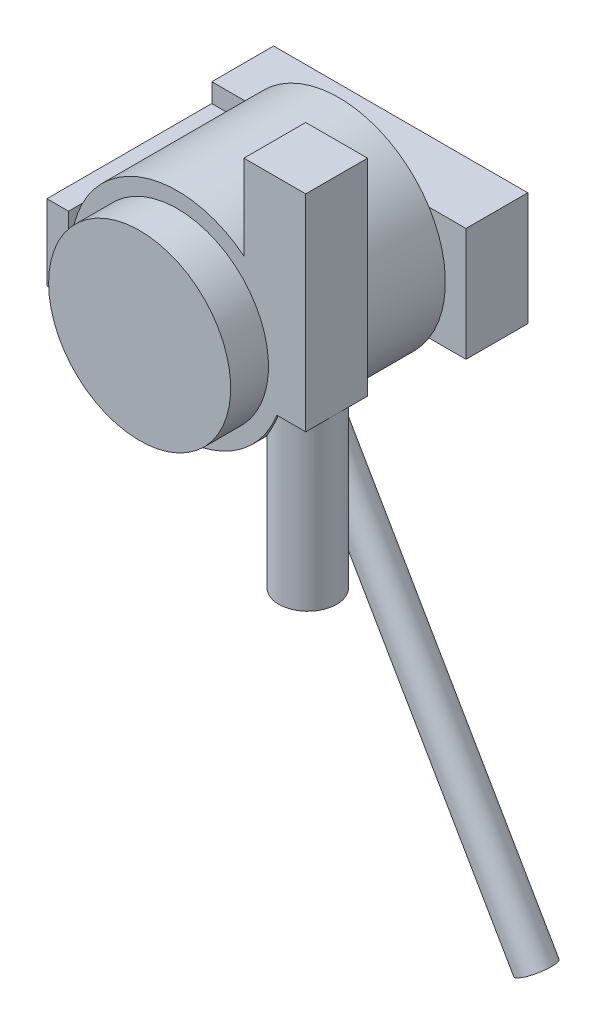
ISO-10303-21;
HEADER;
FILE_DESCRIPTION(('STEP AP214'),'2;1');
FILE_NAME('part.step','',(''),(''),'','','');
FILE_SCHEMA(('AUTOMOTIVE_DESIGN { 1 0 10303 214 1 1 1 1 }'));
ENDSEC;
DATA;
#1=APPLICATION_CONTEXT('core data for automotive mechanical design processes');
#2=APPLICATION_PROTOCOL_DEFINITION('international standard','automotive_design',2000,#1);
#3=PRODUCT_CONTEXT('',#1,'mechanical');
#4=PRODUCT('Part','Part','',(#3));
#5=PRODUCT_RELATED_PRODUCT_CATEGORY('part','',(#4));
#6=PRODUCT_DEFINITION_FORMATION('','',#4);
#7=PRODUCT_DEFINITION_CONTEXT('part definition',#1,'design');
#8=PRODUCT_DEFINITION('design','',#6,#7);
#9=PRODUCT_DEFINITION_SHAPE('','',#8);
#10=(LENGTH_UNIT() NAMED_UNIT(*) SI_UNIT(.MILLI.,.METRE.));
#11=(NAMED_UNIT(*) PLANE_ANGLE_UNIT() SI_UNIT($,.RADIAN.));
#12=(NAMED_UNIT(*) SI_UNIT($,.STERADIAN.) SOLID_ANGLE_UNIT());
#13=UNCERTAINTY_MEASURE_WITH_UNIT(LENGTH_MEASURE(1.E-05),#10,'distance_accuracy_value','');
#14=(GEOMETRIC_REPRESENTATION_CONTEXT(3) GLOBAL_UNCERTAINTY_ASSIGNED_CONTEXT((#13)) GLOBAL_UNIT_ASSIGNED_CONTEXT((#10,
#11,#12)) REPRESENTATION_CONTEXT('',''));
#15=CARTESIAN_POINT('',(0.,0.,0.));
#16=DIRECTION('',(0.,0.,1.));
#17=DIRECTION('',(1.,0.,0.));
#18=AXIS2_PLACEMENT_3D('',#15,#16,#17);
#19=CARTESIAN_POINT('',(45.9481178205376,-93.825,88.9));
#20=DIRECTION('',(0.,1.,0.));
#21=DIRECTION('',(0.,0.,1.));
#22=AXIS2_PLACEMENT_3D('',#19,#20,#21);
#23=CYLINDRICAL_SURFACE('',#22,13.3393821794624);
#24=CARTESIAN_POINT('',(45.9481178205376,-17.625,88.9));
#25=DIRECTION('',(0.,1.,0.));
#26=DIRECTION('',(0.,0.,1.));
#27=AXIS2_PLACEMENT_3D('',#24,#25,#26);
#28=CIRCLE('',#27,13.3393821794624);
#29=CARTESIAN_POINT('',(45.9481178205376,-17.625,102.239382179462));
#30=VERTEX_POINT('',#29);
#31=CARTESIAN_POINT('',(59.2875,-17.625,88.9));
#32=VERTEX_POINT('',#31);
#33=EDGE_CURVE('E232',#30,#32,#28,.T.);
#34=ORIENTED_EDGE('',*,*,#33,.F.);
#35=CARTESIAN_POINT('',(45.9481178205376,-17.625,75.5606178205375));
#36=CARTESIAN_POINT('',(45.7850283293745,-18.0501852849905,75.5606363292623));
#37=CARTESIAN_POINT('',(45.6160198088764,-18.4731255684856,75.5636099906256));
#38=CARTESIAN_POINT('',(45.2663431452935,-19.3141306011233,75.5768977045188));
#39=CARTESIAN_POINT('',(45.0856728235873,-19.7321944219357,75.5872131322447));
#40=CARTESIAN_POINT('',(44.7122985031022,-20.5642691077765,75.616663940997));
#41=CARTESIAN_POINT('',(44.5195568359291,-20.9782620925879,75.6358282548013));
#42=CARTESIAN_POINT('',(44.1228851542527,-21.8002150076966,75.6845702641384));
#43=CARTESIAN_POINT('',(43.9189557631223,-22.2081752725283,75.7141473799729));
#44=CARTESIAN_POINT('',(43.4971195417127,-23.0235663506581,75.7859544948887));
#45=CARTESIAN_POINT('',(43.2790480970429,-23.4308960630801,75.8283688883551));
#46=CARTESIAN_POINT('',(42.8323064654398,-24.2379117719866,75.9275988081342));
#47=CARTESIAN_POINT('',(42.6036368489969,-24.6375981782713,75.9844135600222));
#48=CARTESIAN_POINT('',(42.1367090043231,-25.4279030187809,76.1144248092656));
#49=CARTESIAN_POINT('',(41.898464221739,-25.8185330322634,76.1875989512116));
#50=CARTESIAN_POINT('',(41.4130669222193,-26.5901437632793,76.352565015676));
#51=CARTESIAN_POINT('',(41.1659159918857,-26.9711261791114,76.4443536354358));
#52=CARTESIAN_POINT('',(40.6475184222997,-27.7467267718029,76.6555674155957));
#53=CARTESIAN_POINT('',(40.3757507907897,-28.1406170942333,76.776403121361));
#54=CARTESIAN_POINT('',(39.8253283063993,-28.9143348086894,77.0448608583029));
#55=CARTESIAN_POINT('',(39.5466729006734,-29.2941610657142,77.1924850457201));
#56=CARTESIAN_POINT('',(38.986102739484,-30.0361328716376,77.516945318419));
#57=CARTESIAN_POINT('',(38.7042047943578,-30.3983412195405,77.693666012372));
#58=CARTESIAN_POINT('',(38.1393347426909,-31.104106345403,78.0796953937284));
#59=CARTESIAN_POINT('',(37.8563628688034,-31.4476669410933,78.2889973766083));
#60=CARTESIAN_POINT('',(37.3433605235149,-32.0542082082138,78.7026613036047));
#61=CARTESIAN_POINT('',(37.1128441011285,-32.3206711977625,78.9013119675197));
#62=CARTESIAN_POINT('',(36.6566064646245,-32.8372046750975,79.3238028329243));
#63=CARTESIAN_POINT('',(36.4308841771766,-33.087278858791,79.5476373239568));
#64=CARTESIAN_POINT('',(35.9874622445939,-33.5690316191516,80.0213917941978));
#65=CARTESIAN_POINT('',(35.7697599778493,-33.8007162361702,80.271303145087));
#66=CARTESIAN_POINT('',(35.3459581395932,-34.2436462170447,80.7976909314761));
#67=CARTESIAN_POINT('',(35.1398559547665,-34.454896192272,81.0741613453415));
#68=CARTESIAN_POINT('',(34.7833130809137,-34.8143917300752,81.594882877108));
#69=CARTESIAN_POINT('',(34.6300370070691,-34.9667455993692,81.8343656755764));
#70=CARTESIAN_POINT('',(34.3355711719435,-35.2559395780091,82.3295501382023));
#71=CARTESIAN_POINT('',(34.1943787920331,-35.392783050673,82.5852482673556));
#72=CARTESIAN_POINT('',(33.9262554830015,-35.6498788573786,83.1119732327698));
#73=CARTESIAN_POINT('',(33.7993222194261,-35.7701339079578,83.3829975489244));
#74=CARTESIAN_POINT('',(33.5618242760434,-35.9930639571399,83.9391272687547));
#75=CARTESIAN_POINT('',(33.4512599014892,-36.095738627903,84.2242329348923));
#76=CARTESIAN_POINT('',(33.247879958153,-36.2831627731605,84.8086218386205));
#77=CARTESIAN_POINT('',(33.1551790924692,-36.3677967525336,85.1079822459694));
#78=CARTESIAN_POINT('',(32.9902004394743,-36.517519955189,85.7170713481017));
#79=CARTESIAN_POINT('',(32.9179229751584,-36.5826088693681,86.026800206775));
#80=CARTESIAN_POINT('',(32.7952990002675,-36.6925784903267,86.6539944724956));
#81=CARTESIAN_POINT('',(32.7449452551267,-36.7374658635385,86.9714572908574));
#82=CARTESIAN_POINT('',(32.6672117517874,-36.8066048745461,87.6113938743908));
#83=CARTESIAN_POINT('',(32.6398296068328,-36.8308586561819,87.933867115431));
#84=CARTESIAN_POINT('',(32.6102614770623,-36.8570389308641,88.5468162037895));
#85=CARTESIAN_POINT('',(32.6057306032599,-36.8610434373321,88.8370943403532));
#86=CARTESIAN_POINT('',(32.6156065215821,-36.8523054802788,89.4170607771622));
#87=CARTESIAN_POINT('',(32.6300117679213,-36.8395643837276,89.7067491236195));
#88=CARTESIAN_POINT('',(32.6775010487976,-36.7974466548668,90.2832934077613));
#89=CARTESIAN_POINT('',(32.7105805995597,-36.7680740158519,90.570150008543));
#90=CARTESIAN_POINT('',(32.7948437403376,-36.6929360987634,91.1390118689828));
#91=CARTESIAN_POINT('',(32.8460274890728,-36.6471706769744,91.4210170860862));
#92=CARTESIAN_POINT('',(32.9641193275751,-36.5409786774113,91.9711639678511));
#93=CARTESIAN_POINT('',(33.0305967620745,-36.4809523831968,92.239475870176));
#94=CARTESIAN_POINT('',(33.1788967646995,-36.3461276896179,92.7680026953393));
#95=CARTESIAN_POINT('',(33.2607188618002,-36.2713297436854,93.0282178664318));
#96=CARTESIAN_POINT('',(33.4384997614933,-36.1074990672422,93.5391535255495));
#97=CARTESIAN_POINT('',(33.5344588584527,-36.018466040319,93.7898738157312));
#98=CARTESIAN_POINT('',(33.7391756424792,-35.8267754586706,94.2806656451043));
#99=CARTESIAN_POINT('',(33.8479347629442,-35.7241163778806,94.5207359875191));
#100=CARTESIAN_POINT('',(34.0850960364576,-35.4979594129291,95.0062259496359));
#101=CARTESIAN_POINT('',(34.2143498904387,-35.3734914735904,95.2507772162507));
#102=CARTESIAN_POINT('',(34.4841116210843,-35.1105635385418,95.72570726007));
#103=CARTESIAN_POINT('',(34.6246197199902,-34.9721032665066,95.9560857572414));
#104=CARTESIAN_POINT('',(34.9151408753514,-34.6820590021983,96.402227718645));
#105=CARTESIAN_POINT('',(35.065156975031,-34.530470802325,96.6179864573466));
#106=CARTESIAN_POINT('',(35.3729285327998,-34.2151234929614,97.0345925312868));
#107=CARTESIAN_POINT('',(35.5306854527959,-34.0513620814464,97.2354370317288));
#108=CARTESIAN_POINT('',(35.930250136898,-33.6304521375984,97.7159421868283));
#109=CARTESIAN_POINT('',(36.1757416537443,-33.366505565498,97.9866312307303));
#110=CARTESIAN_POINT('',(36.6752910612794,-32.8166316936644,98.4958930455081));
#111=CARTESIAN_POINT('',(36.9293522435876,-32.5306958926037,98.7344532959023));
#112=CARTESIAN_POINT('',(37.4421923881448,-31.9390952833113,99.1812538256778));
#113=CARTESIAN_POINT('',(37.7009777983759,-31.6334017969049,99.3894485354947));
#114=CARTESIAN_POINT('',(38.2193725228988,-31.0050930133637,99.7770569337767));
#115=CARTESIAN_POINT('',(38.4789818374198,-30.6824777115209,99.956470614234));
#116=CARTESIAN_POINT('',(39.1230015275927,-29.8605200305823,100.37026026478));
#117=CARTESIAN_POINT('',(39.5062107721469,-29.352064398853,100.588470528019));
#118=CARTESIAN_POINT('',(40.2610338946476,-28.307863662486,100.973769388855));
#119=CARTESIAN_POINT('',(40.6326412463026,-27.7721036292313,101.140829662837));
#120=CARTESIAN_POINT('',(41.3603941566605,-26.6762459849298,101.431798261981));
#121=CARTESIAN_POINT('',(41.7164833279104,-26.1160723705703,101.555559117703));
#122=CARTESIAN_POINT('',(42.4083603304322,-24.9768948991303,101.766234204345));
#123=CARTESIAN_POINT('',(42.7441524451084,-24.3978950550023,101.853156233014));
#124=CARTESIAN_POINT('',(43.3442589438274,-23.3124416453379,101.985817996853));
#125=CARTESIAN_POINT('',(43.6117143461181,-22.8082207361502,102.035792210333));
#126=CARTESIAN_POINT('',(44.1294719483856,-21.7895914594517,102.117424531596));
#127=CARTESIAN_POINT('',(44.3797735058133,-21.275182711254,102.149081953597));
#128=CARTESIAN_POINT('',(44.8601467490877,-20.242491718455,102.19711288351));
#129=CARTESIAN_POINT('',(45.0903928468562,-19.7242970185116,102.213633323037));
#130=CARTESIAN_POINT('',(45.532858253958,-18.680220746306,102.234743332024));
#131=CARTESIAN_POINT('',(45.7450835183454,-18.1543417811985,102.239336857737));
#132=CARTESIAN_POINT('',(45.9481178205376,-17.625,102.239382179462));
#133=B_SPLINE_CURVE_WITH_KNOTS('',3,(#35,#36,#37,#38,#39,#40,#41,#42,#43,#44,#45,#46,#47,#48,
#49,#50,#51,#52,#53,#54,#55,#56,#57,#58,#59,#60,#61,#62,#63,#64,#65,#66,#67,#68,#69,#70,#71,#72,
#73,#74,#75,#76,#77,#78,#79,#80,#81,#82,#83,#84,#85,#86,#87,#88,#89,#90,#91,#92,#93,#94,#95,#96,
#97,#98,#99,#100,#101,#102,#103,#104,#105,#106,#107,#108,#109,#110,#111,#112,#113,#114,#115,
#116,#117,#118,#119,#120,#121,#122,#123,#124,#125,#126,#127,#128,#129,#130,#131,#132),
.UNSPECIFIED.,.F.,.F.,(4,2,2,2,2,2,2,2,2,2,2,2,2,2,2,2,2,2,2,2,2,2,2,2,2,2,2,2,2,2,2,2,2,2,2,2,
2,2,2,2,2,2,2,2,2,2,2,2,4),(0.,1.36615444656034,2.7325648566726,4.10347493908439,
5.47430871268624,6.86585137020907,8.25731920900492,9.64689707909072,11.0362286123591,
12.5160417415762,13.9959740358143,15.4701726379126,16.944068281909,18.1564788796884,
19.368615114157,20.5803515408536,21.7918138807089,22.7586291552043,23.7252343800457,
24.6916811242041,25.6581458887457,26.6306234774797,27.6031164450393,28.5752882578489,
29.5473590491983,30.4173034000388,31.2871767403482,32.1568413093726,33.0265135029272,
33.8741797973363,34.721820075756,35.5694780066178,36.4172309520801,37.3262818781417,
38.2353507599577,39.144712091235,40.0542458276249,41.4045409238888,42.7553607122904,
44.108187265992,45.4610141960851,47.4769501737443,49.4940004381894,51.5178549990312,
53.5412809522457,55.2594591800977,56.9777017323707,58.6790832857099,60.379900405009),.UNSPECIFIED.);
#134=CARTESIAN_POINT('',(45.9481178205376,-17.625,75.5606178205375));
#135=VERTEX_POINT('',#134);
#136=EDGE_CURVE('E20',#135,#30,#133,.T.);
#137=ORIENTED_EDGE('',*,*,#136,.F.);
#138=CARTESIAN_POINT('',(45.9481178205376,-17.625,88.9));
#139=DIRECTION('',(0.,1.,0.));
#140=DIRECTION('',(0.,0.,1.));
#141=AXIS2_PLACEMENT_3D('',#138,#139,#140);
#142=CIRCLE('',#141,13.3393821794624);
#143=EDGE_CURVE('E40',#32,#135,#142,.T.);
#144=ORIENTED_EDGE('',*,*,#143,.F.);
#145=EDGE_LOOP('',(#34,#137,#144));
#146=FACE_BOUND('',#145,.T.);
#147=CARTESIAN_POINT('',(45.9481178205376,-93.825,88.9));
#148=DIRECTION('',(0.,1.,0.));
#149=DIRECTION('',(0.,0.,1.));
#150=AXIS2_PLACEMENT_3D('',#147,#148,#149);
#151=CIRCLE('',#150,13.3393821794624);
#152=CARTESIAN_POINT('',(45.9481178205376,-93.825,102.239382179462));
#153=VERTEX_POINT('',#152);
#154=EDGE_CURVE('E11',#153,#153,#151,.T.);
#155=ORIENTED_EDGE('',*,*,#154,.T.);
#156=EDGE_LOOP('',(#155));
#157=FACE_BOUND('',#156,.T.);
#158=ADVANCED_FACE('F16',(#146,#157),#23,.T.);
#159=CARTESIAN_POINT('',(0.,0.,120.65));
#160=DIRECTION('',(0.,0.,-1.));
#161=DIRECTION('',(-1.,0.,0.));
#162=AXIS2_PLACEMENT_3D('',#159,#160,#161);
#163=CYLINDRICAL_SURFACE('',#162,42.06875);
#164=CARTESIAN_POINT('',(0.,0.,103.1875));
#165=DIRECTION('',(0.,0.,-1.));
#166=DIRECTION('',(-1.,0.,0.));
#167=AXIS2_PLACEMENT_3D('',#164,#165,#166);
#168=CIRCLE('',#167,42.06875);
#169=CARTESIAN_POINT('',(-42.06875,0.,103.1875));
#170=VERTEX_POINT('',#169);
#171=EDGE_CURVE('E213',#170,#170,#168,.T.);
#172=ORIENTED_EDGE('',*,*,#171,.F.);
#173=EDGE_LOOP('',(#172));
#174=FACE_BOUND('',#173,.T.);
#175=CARTESIAN_POINT('',(0.,0.,120.65));
#176=DIRECTION('',(0.,0.,-1.));
#177=DIRECTION('',(-1.,0.,0.));
#178=AXIS2_PLACEMENT_3D('',#175,#176,#177);
#179=CIRCLE('',#178,42.06875);
#180=CARTESIAN_POINT('',(-42.06875,0.,120.65));
#181=VERTEX_POINT('',#180);
#182=EDGE_CURVE('E32',#181,#181,#179,.T.);
#183=ORIENTED_EDGE('',*,*,#182,.T.);
#184=EDGE_LOOP('',(#183));
#185=FACE_BOUND('',#184,.T.);
#186=ADVANCED_FACE('F406',(#174,#185),#163,.T.);
#187=CARTESIAN_POINT('',(126.20625,-218.59563723274,63.4898768792733));
#188=DIRECTION('',(-0.499999999999998,0.86602540378444,0.));
#189=DIRECTION('',(-0.86602540378444,-0.499999999999998,0.));
#190=AXIS2_PLACEMENT_3D('',#187,#188,#189);
#191=CYLINDRICAL_SURFACE('',#190,7.9375);
#192=CARTESIAN_POINT('',(24.6062499999999,-42.6192751837417,63.4898768792733));
#193=DIRECTION('',(-0.499999999999998,0.86602540378444,0.));
#194=DIRECTION('',(-0.86602540378444,-0.499999999999998,0.));
#195=AXIS2_PLACEMENT_3D('',#192,#193,#194);
#196=CIRCLE('',#195,7.9375);
#197=CARTESIAN_POINT('',(17.7321733574609,-46.5880251837417,63.4898768792733));
#198=VERTEX_POINT('',#197);
#199=EDGE_CURVE('E329',#198,#198,#196,.T.);
#200=ORIENTED_EDGE('',*,*,#199,.F.);
#201=EDGE_LOOP('',(#200));
#202=FACE_BOUND('',#201,.T.);
#203=CARTESIAN_POINT('',(126.20625,-218.59563723274,63.4898768792733));
#204=DIRECTION('',(-0.499999999999998,0.86602540378444,0.));
#205=DIRECTION('',(-0.86602540378444,-0.499999999999998,0.));
#206=AXIS2_PLACEMENT_3D('',#203,#204,#205);
#207=CIRCLE('',#206,7.9375);
#208=CARTESIAN_POINT('',(119.332173357461,-222.56438723274,63.4898768792733));
#209=VERTEX_POINT('',#208);
#210=EDGE_CURVE('E198',#209,#209,#207,.T.);
#211=ORIENTED_EDGE('',*,*,#210,.T.);
#212=EDGE_LOOP('',(#211));
#213=FACE_BOUND('',#212,.T.);
#214=ADVANCED_FACE('F726',(#202,#213),#191,.T.);
#215=CARTESIAN_POINT('',(0.,0.,103.1875));
#216=DIRECTION('',(0.,0.,-1.));
#217=DIRECTION('',(-1.,0.,0.));
#218=AXIS2_PLACEMENT_3D('',#215,#216,#217);
#219=CYLINDRICAL_SURFACE('',#218,49.2125);
#220=CARTESIAN_POINT('',(0.,0.,74.6125));
#221=DIRECTION('',(0.,0.,-1.));
#222=DIRECTION('',(-1.,0.,0.));
#223=AXIS2_PLACEMENT_3D('',#220,#221,#222);
#224=CIRCLE('',#223,49.2125);
#225=CARTESIAN_POINT('',(30.7125,38.4527307222777,74.6125));
#226=VERTEX_POINT('',#225);
#227=CARTESIAN_POINT('',(45.9481178205376,-17.625,74.6125));
#228=VERTEX_POINT('',#227);
#229=EDGE_CURVE('E182',#226,#228,#224,.T.);
#230=ORIENTED_EDGE('',*,*,#229,.T.);
#231=DIRECTION('',(0.,0.,-1.));
#232=VECTOR('',#231,1.);
#233=CARTESIAN_POINT('',(45.9481178205376,-17.625,74.6125));
#234=LINE('',#233,#232);
#235=EDGE_CURVE('E303',#135,#228,#234,.T.);
#236=ORIENTED_EDGE('',*,*,#235,.F.);
#237=ORIENTED_EDGE('',*,*,#136,.T.);
#238=DIRECTION('',(0.,0.,-1.));
#239=VECTOR('',#238,1.);
#240=CARTESIAN_POINT('',(45.9481178205376,-17.625,74.6125));
#241=LINE('',#240,#239);
#242=CARTESIAN_POINT('',(45.9481178205376,-17.625,103.1875));
#243=VERTEX_POINT('',#242);
#244=EDGE_CURVE('E312',#243,#30,#241,.T.);
#245=ORIENTED_EDGE('',*,*,#244,.F.);
#246=CARTESIAN_POINT('',(0.,0.,103.1875));
#247=DIRECTION('',(0.,0.,-1.));
#248=DIRECTION('',(-1.,0.,0.));
#249=AXIS2_PLACEMENT_3D('',#246,#247,#248);
#250=CIRCLE('',#249,49.2125);
#251=CARTESIAN_POINT('',(-48.7375,-6.82101532031737,103.1875));
#252=VERTEX_POINT('',#251);
#253=EDGE_CURVE('E354',#243,#252,#250,.T.);
#254=ORIENTED_EDGE('',*,*,#253,.T.);
#255=DIRECTION('',(0.,0.,-1.));
#256=VECTOR('',#255,1.);
#257=CARTESIAN_POINT('',(-48.7375,-6.82101532031738,103.1875));
#258=LINE('',#257,#256);
#259=CARTESIAN_POINT('',(-48.7375,-6.82101532031737,28.575));
#260=VERTEX_POINT('',#259);
#261=EDGE_CURVE('E359',#252,#260,#258,.T.);
#262=ORIENTED_EDGE('',*,*,#261,.T.);
#263=CARTESIAN_POINT('',(0.,0.,28.575));
#264=DIRECTION('',(0.,0.,1.));
#265=DIRECTION('',(-1.,0.,0.));
#266=AXIS2_PLACEMENT_3D('',#263,#264,#265);
#267=CIRCLE('',#266,49.2125);
#268=CARTESIAN_POINT('',(-41.662424523634,-26.19375,28.575));
#269=VERTEX_POINT('',#268);
#270=EDGE_CURVE('E361',#260,#269,#267,.T.);
#271=ORIENTED_EDGE('',*,*,#270,.T.);
#272=CARTESIAN_POINT('',(0.,0.,28.575));
#273=DIRECTION('',(0.,0.,1.));
#274=DIRECTION('',(-1.,0.,0.));
#275=AXIS2_PLACEMENT_3D('',#272,#273,#274);
#276=CIRCLE('',#275,49.2125);
#277=CARTESIAN_POINT('',(41.662424523634,-26.19375,28.575));
#278=VERTEX_POINT('',#277);
#279=EDGE_CURVE('E367',#269,#278,#276,.T.);
#280=ORIENTED_EDGE('',*,*,#279,.T.);
#281=CARTESIAN_POINT('',(0.,0.,28.575));
#282=DIRECTION('',(0.,0.,1.));
#283=DIRECTION('',(-1.,0.,0.));
#284=AXIS2_PLACEMENT_3D('',#281,#282,#283);
#285=CIRCLE('',#284,49.2125);
#286=CARTESIAN_POINT('',(41.662424523634,26.19375,28.575));
#287=VERTEX_POINT('',#286);
#288=EDGE_CURVE('E370',#278,#287,#285,.T.);
#289=ORIENTED_EDGE('',*,*,#288,.T.);
#290=CARTESIAN_POINT('',(0.,0.,28.575));
#291=DIRECTION('',(0.,0.,1.));
#292=DIRECTION('',(-1.,0.,0.));
#293=AXIS2_PLACEMENT_3D('',#290,#291,#292);
#294=CIRCLE('',#293,49.2125);
#295=CARTESIAN_POINT('',(-41.662424523634,26.19375,28.575));
#296=VERTEX_POINT('',#295);
#297=EDGE_CURVE('E373',#287,#296,#294,.T.);
#298=ORIENTED_EDGE('',*,*,#297,.T.);
#299=CARTESIAN_POINT('',(0.,0.,28.575));
#300=DIRECTION('',(0.,0.,1.));
#301=DIRECTION('',(-1.,0.,0.));
#302=AXIS2_PLACEMENT_3D('',#299,#300,#301);
#303=CIRCLE('',#302,49.2125);
#304=CARTESIAN_POINT('',(-48.7375,6.82101532031735,28.575));
#305=VERTEX_POINT('',#304);
#306=EDGE_CURVE('E376',#296,#305,#303,.T.);
#307=ORIENTED_EDGE('',*,*,#306,.T.);
#308=DIRECTION('',(0.,0.,1.));
#309=VECTOR('',#308,1.);
#310=CARTESIAN_POINT('',(-48.7375,6.82101532031735,103.1875));
#311=LINE('',#310,#309);
#312=CARTESIAN_POINT('',(-48.7375,6.82101532031735,103.1875));
#313=VERTEX_POINT('',#312);
#314=EDGE_CURVE('E379',#305,#313,#311,.T.);
#315=ORIENTED_EDGE('',*,*,#314,.T.);
#316=CARTESIAN_POINT('',(0.,0.,103.1875));
#317=DIRECTION('',(0.,0.,-1.));
#318=DIRECTION('',(-1.,0.,0.));
#319=AXIS2_PLACEMENT_3D('',#316,#317,#318);
#320=CIRCLE('',#319,49.2125);
#321=CARTESIAN_POINT('',(30.7125,38.4527307222777,103.1875));
#322=VERTEX_POINT('',#321);
#323=EDGE_CURVE('E185',#313,#322,#320,.T.);
#324=ORIENTED_EDGE('',*,*,#323,.T.);
#325=DIRECTION('',(0.,0.,-1.));
#326=VECTOR('',#325,1.);
#327=CARTESIAN_POINT('',(30.7125,38.4527307222777,103.1875));
#328=LINE('',#327,#326);
#329=EDGE_CURVE('E178',#322,#226,#328,.T.);
#330=ORIENTED_EDGE('',*,*,#329,.T.);
#331=EDGE_LOOP('',(#230,#236,#237,#245,#254,#262,#271,#280,#289,#298,#307,#315,#324,#330));
#332=FACE_BOUND('',#331,.T.);
#333=CARTESIAN_POINT('',(0.,0.,50.9449462977674));
#334=DIRECTION('',(0.,0.,-1.));
#335=DIRECTION('',(-1.,0.,0.));
#336=AXIS2_PLACEMENT_3D('',#333,#334,#335);
#337=CIRCLE('',#336,49.2125);
#338=CARTESIAN_POINT('',(34.5218201413073,-35.0729823422706,50.9449462977674));
#339=VERTEX_POINT('',#338);
#340=CARTESIAN_POINT('',(24.6062499999999,-42.6192751837417,50.9449462977674));
#341=VERTEX_POINT('',#340);
#342=EDGE_CURVE('E189',#339,#341,#337,.T.);
#343=ORIENTED_EDGE('',*,*,#342,.T.);
#344=CARTESIAN_POINT('',(0.,0.,50.9449462977674));
#345=DIRECTION('',(0.,0.,-1.));
#346=DIRECTION('',(-1.,0.,0.));
#347=AXIS2_PLACEMENT_3D('',#344,#345,#346);
#348=CIRCLE('',#347,49.2125);
#349=CARTESIAN_POINT('',(12.4340295875087,-47.6158068761515,50.9449462977674));
#350=VERTEX_POINT('',#349);
#351=EDGE_CURVE('E384',#341,#350,#348,.T.);
#352=ORIENTED_EDGE('',*,*,#351,.T.);
#353=DIRECTION('',(0.,0.,1.));
#354=VECTOR('',#353,1.);
#355=CARTESIAN_POINT('',(12.4340295875088,-47.6158068761515,103.1875));
#356=LINE('',#355,#354);
#357=CARTESIAN_POINT('',(12.4340295875087,-47.6158068761515,76.3449462977675));
#358=VERTEX_POINT('',#357);
#359=EDGE_CURVE('E387',#350,#358,#356,.T.);
#360=ORIENTED_EDGE('',*,*,#359,.T.);
#361=CARTESIAN_POINT('',(0.,0.,76.3449462977675));
#362=DIRECTION('',(0.,0.,1.));
#363=DIRECTION('',(-1.,0.,0.));
#364=AXIS2_PLACEMENT_3D('',#361,#362,#363);
#365=CIRCLE('',#364,49.2125);
#366=CARTESIAN_POINT('',(24.6062499999999,-42.6192751837417,76.3449462977675));
#367=VERTEX_POINT('',#366);
#368=EDGE_CURVE('E390',#358,#367,#365,.T.);
#369=ORIENTED_EDGE('',*,*,#368,.T.);
#370=CARTESIAN_POINT('',(0.,0.,76.3449462977675));
#371=DIRECTION('',(0.,0.,1.));
#372=DIRECTION('',(-1.,0.,0.));
#373=AXIS2_PLACEMENT_3D('',#370,#371,#372);
#374=CIRCLE('',#373,49.2125);
#375=CARTESIAN_POINT('',(34.5218201413073,-35.0729823422706,76.3449462977675));
#376=VERTEX_POINT('',#375);
#377=EDGE_CURVE('E393',#367,#376,#374,.T.);
#378=ORIENTED_EDGE('',*,*,#377,.T.);
#379=DIRECTION('',(0.,0.,-1.));
#380=VECTOR('',#379,1.);
#381=CARTESIAN_POINT('',(34.5218201413073,-35.0729823422706,103.1875));
#382=LINE('',#381,#380);
#383=EDGE_CURVE('E396',#376,#339,#382,.T.);
#384=ORIENTED_EDGE('',*,*,#383,.T.);
#385=EDGE_LOOP('',(#343,#352,#360,#369,#378,#384));
#386=FACE_BOUND('',#385,.T.);
#387=ADVANCED_FACE('F180',(#332,#386),#219,.T.);
#388=CARTESIAN_POINT('',(59.2875,77.625,74.6125));
#389=DIRECTION('',(0.,0.,-1.));
#390=DIRECTION('',(-1.,0.,0.));
#391=AXIS2_PLACEMENT_3D('',#388,#389,#390);
#392=PLANE('',#391);
#393=DIRECTION('',(0.,-1.,0.));
#394=VECTOR('',#393,1.);
#395=CARTESIAN_POINT('',(59.2875,77.625,74.6125));
#396=LINE('',#395,#394);
#397=CARTESIAN_POINT('',(59.2875,77.625,74.6125));
#398=VERTEX_POINT('',#397);
#399=CARTESIAN_POINT('',(59.2875,-17.625,74.6125));
#400=VERTEX_POINT('',#399);
#401=EDGE_CURVE('E205',#398,#400,#396,.T.);
#402=ORIENTED_EDGE('',*,*,#401,.T.);
#403=DIRECTION('',(-1.,0.,0.));
#404=VECTOR('',#403,1.);
#405=CARTESIAN_POINT('',(59.2875,-17.625,74.6125));
#406=LINE('',#405,#404);
#407=EDGE_CURVE('E197',#400,#228,#406,.T.);
#408=ORIENTED_EDGE('',*,*,#407,.T.);
#409=ORIENTED_EDGE('',*,*,#229,.F.);
#410=DIRECTION('',(0.,1.,0.));
#411=VECTOR('',#410,1.);
#412=CARTESIAN_POINT('',(30.7125,77.625,74.6125));
#413=LINE('',#412,#411);
#414=CARTESIAN_POINT('',(30.7125,77.625,74.6125));
#415=VERTEX_POINT('',#414);
#416=EDGE_CURVE('E195',#226,#415,#413,.T.);
#417=ORIENTED_EDGE('',*,*,#416,.T.);
#418=DIRECTION('',(1.,0.,0.));
#419=VECTOR('',#418,1.);
#420=CARTESIAN_POINT('',(59.2875,77.625,74.6125));
#421=LINE('',#420,#419);
#422=EDGE_CURVE('E203',#415,#398,#421,.T.);
#423=ORIENTED_EDGE('',*,*,#422,.T.);
#424=EDGE_LOOP('',(#402,#408,#409,#417,#423));
#425=FACE_BOUND('',#424,.T.);
#426=ADVANCED_FACE('F194',(#425),#392,.T.);
#427=CARTESIAN_POINT('',(30.7125,-17.625,74.6125));
#428=DIRECTION('',(-1.,0.,0.));
#429=DIRECTION('',(0.,-1.,0.));
#430=AXIS2_PLACEMENT_3D('',#427,#428,#429);
#431=PLANE('',#430);
#432=DIRECTION('',(0.,0.,-1.));
#433=VECTOR('',#432,1.);
#434=CARTESIAN_POINT('',(30.7125,77.625,74.6125));
#435=LINE('',#434,#433);
#436=CARTESIAN_POINT('',(30.7125,77.625,103.1875));
#437=VERTEX_POINT('',#436);
#438=EDGE_CURVE('E202',#437,#415,#435,.T.);
#439=ORIENTED_EDGE('',*,*,#438,.T.);
#440=ORIENTED_EDGE('',*,*,#416,.F.);
#441=ORIENTED_EDGE('',*,*,#329,.F.);
#442=DIRECTION('',(0.,1.,0.));
#443=VECTOR('',#442,1.);
#444=CARTESIAN_POINT('',(30.7125,-17.625,103.1875));
#445=LINE('',#444,#443);
#446=EDGE_CURVE('E211',#322,#437,#445,.T.);
#447=ORIENTED_EDGE('',*,*,#446,.T.);
#448=EDGE_LOOP('',(#439,#440,#441,#447));
#449=FACE_BOUND('',#448,.T.);
#450=ADVANCED_FACE('F200',(#449),#431,.T.);
#451=CARTESIAN_POINT('',(0.,0.,103.1875));
#452=DIRECTION('',(0.,0.,1.));
#453=DIRECTION('',(1.,0.,0.));
#454=AXIS2_PLACEMENT_3D('',#451,#452,#453);
#455=PLANE('',#454);
#456=ORIENTED_EDGE('',*,*,#171,.T.);
#457=EDGE_LOOP('',(#456));
#458=FACE_BOUND('',#457,.T.);
#459=ORIENTED_EDGE('',*,*,#323,.F.);
#460=DIRECTION('',(0.,-1.,0.));
#461=VECTOR('',#460,1.);
#462=CARTESIAN_POINT('',(-48.7375,0.,103.1875));
#463=LINE('',#462,#461);
#464=EDGE_CURVE('E214',#313,#252,#463,.T.);
#465=ORIENTED_EDGE('',*,*,#464,.T.);
#466=ORIENTED_EDGE('',*,*,#253,.F.);
#467=DIRECTION('',(1.,0.,0.));
#468=VECTOR('',#467,1.);
#469=CARTESIAN_POINT('',(0.,-17.625,103.1875));
#470=LINE('',#469,#468);
#471=CARTESIAN_POINT('',(59.2875,-17.625,103.1875));
#472=VERTEX_POINT('',#471);
#473=EDGE_CURVE('E217',#243,#472,#470,.T.);
#474=ORIENTED_EDGE('',*,*,#473,.T.);
#475=DIRECTION('',(0.,1.,0.));
#476=VECTOR('',#475,1.);
#477=CARTESIAN_POINT('',(59.2875,0.,103.1875));
#478=LINE('',#477,#476);
#479=CARTESIAN_POINT('',(59.2875,77.625,103.1875));
#480=VERTEX_POINT('',#479);
#481=EDGE_CURVE('E220',#472,#480,#478,.T.);
#482=ORIENTED_EDGE('',*,*,#481,.T.);
#483=DIRECTION('',(-1.,0.,0.));
#484=VECTOR('',#483,1.);
#485=CARTESIAN_POINT('',(0.,77.625,103.1875));
#486=LINE('',#485,#484);
#487=EDGE_CURVE('E223',#480,#437,#486,.T.);
#488=ORIENTED_EDGE('',*,*,#487,.T.);
#489=ORIENTED_EDGE('',*,*,#446,.F.);
#490=EDGE_LOOP('',(#459,#465,#466,#474,#482,#488,#489));
#491=FACE_BOUND('',#490,.T.);
#492=ADVANCED_FACE('F357',(#458,#491),#455,.T.);
#493=CARTESIAN_POINT('',(-48.7375,17.4625,28.575));
#494=DIRECTION('',(-1.,0.,0.));
#495=DIRECTION('',(0.,0.,1.));
#496=AXIS2_PLACEMENT_3D('',#493,#494,#495);
#497=PLANE('',#496);
#498=ORIENTED_EDGE('',*,*,#314,.F.);
#499=DIRECTION('',(0.,-1.,0.));
#500=VECTOR('',#499,1.);
#501=CARTESIAN_POINT('',(-48.7375,17.4625,28.575));
#502=LINE('',#501,#500);
#503=CARTESIAN_POINT('',(-48.7375,17.4625,28.575));
#504=VERTEX_POINT('',#503);
#505=EDGE_CURVE('E226',#504,#305,#502,.T.);
#506=ORIENTED_EDGE('',*,*,#505,.F.);
#507=DIRECTION('',(0.,0.,-1.));
#508=VECTOR('',#507,1.);
#509=CARTESIAN_POINT('',(-48.7375,17.4625,28.575));
#510=LINE('',#509,#508);
#511=CARTESIAN_POINT('',(-48.7375,17.4625,104.775));
#512=VERTEX_POINT('',#511);
#513=EDGE_CURVE('E230',#512,#504,#510,.T.);
#514=ORIENTED_EDGE('',*,*,#513,.F.);
#515=DIRECTION('',(0.,1.,0.));
#516=VECTOR('',#515,1.);
#517=CARTESIAN_POINT('',(-48.7375,17.4625,104.775));
#518=LINE('',#517,#516);
#519=CARTESIAN_POINT('',(-48.7375,-17.4625,104.775));
#520=VERTEX_POINT('',#519);
#521=EDGE_CURVE('E234',#520,#512,#518,.T.);
#522=ORIENTED_EDGE('',*,*,#521,.F.);
#523=DIRECTION('',(0.,0.,1.));
#524=VECTOR('',#523,1.);
#525=CARTESIAN_POINT('',(-48.7375,-17.4625,28.575));
#526=LINE('',#525,#524);
#527=CARTESIAN_POINT('',(-48.7375,-17.4625,28.575));
#528=VERTEX_POINT('',#527);
#529=EDGE_CURVE('E238',#528,#520,#526,.T.);
#530=ORIENTED_EDGE('',*,*,#529,.F.);
#531=DIRECTION('',(0.,-1.,0.));
#532=VECTOR('',#531,1.);
#533=CARTESIAN_POINT('',(-48.7375,17.4625,28.575));
#534=LINE('',#533,#532);
#535=EDGE_CURVE('E229',#260,#528,#534,.T.);
#536=ORIENTED_EDGE('',*,*,#535,.F.);
#537=ORIENTED_EDGE('',*,*,#261,.F.);
#538=ORIENTED_EDGE('',*,*,#464,.F.);
#539=EDGE_LOOP('',(#498,#506,#514,#522,#530,#536,#537,#538));
#540=FACE_BOUND('',#539,.T.);
#541=ADVANCED_FACE('F689',(#540),#497,.F.);
#542=CARTESIAN_POINT('',(58.7375,26.19375,28.575));
#543=DIRECTION('',(0.,0.,-1.));
#544=DIRECTION('',(-1.,0.,0.));
#545=AXIS2_PLACEMENT_3D('',#542,#543,#544);
#546=PLANE('',#545);
#547=DIRECTION('',(-1.,0.,0.));
#548=VECTOR('',#547,1.);
#549=CARTESIAN_POINT('',(58.7375,17.4625,28.575));
#550=LINE('',#549,#548);
#551=CARTESIAN_POINT('',(-58.7375,17.4625,28.575));
#552=VERTEX_POINT('',#551);
#553=EDGE_CURVE('E233',#504,#552,#550,.T.);
#554=ORIENTED_EDGE('',*,*,#553,.F.);
#555=ORIENTED_EDGE('',*,*,#505,.T.);
#556=ORIENTED_EDGE('',*,*,#306,.F.);
#557=DIRECTION('',(1.,0.,0.));
#558=VECTOR('',#557,1.);
#559=CARTESIAN_POINT('',(58.7375,26.19375,28.575));
#560=LINE('',#559,#558);
#561=CARTESIAN_POINT('',(-58.7375,26.19375,28.575));
#562=VERTEX_POINT('',#561);
#563=EDGE_CURVE('E248',#562,#296,#560,.T.);
#564=ORIENTED_EDGE('',*,*,#563,.F.);
#565=DIRECTION('',(0.,1.,0.));
#566=VECTOR('',#565,1.);
#567=CARTESIAN_POINT('',(-58.7375,26.19375,28.575));
#568=LINE('',#567,#566);
#569=EDGE_CURVE('E252',#552,#562,#568,.T.);
#570=ORIENTED_EDGE('',*,*,#569,.F.);
#571=EDGE_LOOP('',(#554,#555,#556,#564,#570));
#572=FACE_BOUND('',#571,.T.);
#573=ADVANCED_FACE('F470',(#572),#546,.F.);
#574=CARTESIAN_POINT('',(0.,0.,28.575));
#575=DIRECTION('',(0.,0.,1.));
#576=DIRECTION('',(1.,0.,0.));
#577=AXIS2_PLACEMENT_3D('',#574,#575,#576);
#578=PLANE('',#577);
#579=DIRECTION('',(1.,0.,0.));
#580=VECTOR('',#579,1.);
#581=CARTESIAN_POINT('',(0.,26.19375,28.575));
#582=LINE('',#581,#580);
#583=EDGE_CURVE('E251',#296,#287,#582,.T.);
#584=ORIENTED_EDGE('',*,*,#583,.F.);
#585=ORIENTED_EDGE('',*,*,#297,.F.);
#586=EDGE_LOOP('',(#584,#585));
#587=FACE_BOUND('',#586,.T.);
#588=ADVANCED_FACE('F475',(#587),#578,.F.);
#589=CARTESIAN_POINT('',(58.7375,26.19375,28.575));
#590=DIRECTION('',(0.,0.,-1.));
#591=DIRECTION('',(-1.,0.,0.));
#592=AXIS2_PLACEMENT_3D('',#589,#590,#591);
#593=PLANE('',#592);
#594=DIRECTION('',(-1.,0.,0.));
#595=VECTOR('',#594,1.);
#596=CARTESIAN_POINT('',(58.7375,-26.19375,28.575));
#597=LINE('',#596,#595);
#598=CARTESIAN_POINT('',(58.7375,-26.19375,28.575));
#599=VERTEX_POINT('',#598);
#600=EDGE_CURVE('E258',#599,#278,#597,.T.);
#601=ORIENTED_EDGE('',*,*,#600,.F.);
#602=DIRECTION('',(0.,-1.,0.));
#603=VECTOR('',#602,1.);
#604=CARTESIAN_POINT('',(58.7375,26.19375,28.575));
#605=LINE('',#604,#603);
#606=CARTESIAN_POINT('',(58.7375,26.19375,28.575));
#607=VERTEX_POINT('',#606);
#608=EDGE_CURVE('E261',#607,#599,#605,.T.);
#609=ORIENTED_EDGE('',*,*,#608,.F.);
#610=DIRECTION('',(1.,0.,0.));
#611=VECTOR('',#610,1.);
#612=CARTESIAN_POINT('',(58.7375,26.19375,28.575));
#613=LINE('',#612,#611);
#614=EDGE_CURVE('E257',#287,#607,#613,.T.);
#615=ORIENTED_EDGE('',*,*,#614,.F.);
#616=ORIENTED_EDGE('',*,*,#288,.F.);
#617=EDGE_LOOP('',(#601,#609,#615,#616));
#618=FACE_BOUND('',#617,.T.);
#619=ADVANCED_FACE('F479',(#618),#593,.F.);
#620=CARTESIAN_POINT('',(0.,0.,28.575));
#621=DIRECTION('',(0.,0.,1.));
#622=DIRECTION('',(1.,0.,0.));
#623=AXIS2_PLACEMENT_3D('',#620,#621,#622);
#624=PLANE('',#623);
#625=DIRECTION('',(-1.,0.,0.));
#626=VECTOR('',#625,1.);
#627=CARTESIAN_POINT('',(0.,-26.19375,28.575));
#628=LINE('',#627,#626);
#629=EDGE_CURVE('E260',#278,#269,#628,.T.);
#630=ORIENTED_EDGE('',*,*,#629,.F.);
#631=ORIENTED_EDGE('',*,*,#279,.F.);
#632=EDGE_LOOP('',(#630,#631));
#633=FACE_BOUND('',#632,.T.);
#634=ADVANCED_FACE('F481',(#633),#624,.F.);
#635=CARTESIAN_POINT('',(58.7375,26.19375,28.575));
#636=DIRECTION('',(0.,0.,-1.));
#637=DIRECTION('',(-1.,0.,0.));
#638=AXIS2_PLACEMENT_3D('',#635,#636,#637);
#639=PLANE('',#638);
#640=DIRECTION('',(1.,0.,0.));
#641=VECTOR('',#640,1.);
#642=CARTESIAN_POINT('',(58.7375,-17.4625,28.575));
#643=LINE('',#642,#641);
#644=CARTESIAN_POINT('',(-58.7375,-17.4625,28.575));
#645=VERTEX_POINT('',#644);
#646=EDGE_CURVE('E269',#645,#528,#643,.T.);
#647=ORIENTED_EDGE('',*,*,#646,.F.);
#648=DIRECTION('',(0.,1.,0.));
#649=VECTOR('',#648,1.);
#650=CARTESIAN_POINT('',(-58.7375,26.19375,28.575));
#651=LINE('',#650,#649);
#652=CARTESIAN_POINT('',(-58.7375,-26.19375,28.575));
#653=VERTEX_POINT('',#652);
#654=EDGE_CURVE('E255',#653,#645,#651,.T.);
#655=ORIENTED_EDGE('',*,*,#654,.F.);
#656=DIRECTION('',(-1.,0.,0.));
#657=VECTOR('',#656,1.);
#658=CARTESIAN_POINT('',(58.7375,-26.19375,28.575));
#659=LINE('',#658,#657);
#660=EDGE_CURVE('E268',#269,#653,#659,.T.);
#661=ORIENTED_EDGE('',*,*,#660,.F.);
#662=ORIENTED_EDGE('',*,*,#270,.F.);
#663=ORIENTED_EDGE('',*,*,#535,.T.);
#664=EDGE_LOOP('',(#647,#655,#661,#662,#663));
#665=FACE_BOUND('',#664,.T.);
#666=ADVANCED_FACE('F457',(#665),#639,.F.);
#667=CARTESIAN_POINT('',(30.3105682585358,-27.7788801178402,50.9449462977674));
#668=DIRECTION('',(0.,0.,-1.));
#669=DIRECTION('',(-1.,0.,0.));
#670=AXIS2_PLACEMENT_3D('',#667,#668,#669);
#671=PLANE('',#670);
#672=DIRECTION('',(-0.86602540378444,-0.499999999999998,0.));
#673=VECTOR('',#672,1.);
#674=CARTESIAN_POINT('',(24.6062499999999,-42.6192751837417,50.9449462977674));
#675=LINE('',#674,#673);
#676=CARTESIAN_POINT('',(13.313523002411,-49.1391341556846,50.9449462977674));
#677=VERTEX_POINT('',#676);
#678=EDGE_CURVE('E244',#341,#677,#675,.T.);
#679=ORIENTED_EDGE('',*,*,#678,.T.);
#680=DIRECTION('',(-0.499999999999996,0.866025403784441,0.));
#681=VECTOR('',#680,1.);
#682=CARTESIAN_POINT('',(13.313523002411,-49.1391341556846,50.9449462977674));
#683=LINE('',#682,#681);
#684=EDGE_CURVE('E277',#677,#350,#683,.T.);
#685=ORIENTED_EDGE('',*,*,#684,.T.);
#686=ORIENTED_EDGE('',*,*,#351,.F.);
#687=EDGE_LOOP('',(#679,#685,#686));
#688=FACE_BOUND('',#687,.T.);
#689=ADVANCED_FACE('F494',(#688),#671,.T.);
#690=CARTESIAN_POINT('',(30.3105682585358,-27.7788801178402,50.9449462977674));
#691=DIRECTION('',(0.,0.,-1.));
#692=DIRECTION('',(-1.,0.,0.));
#693=AXIS2_PLACEMENT_3D('',#690,#691,#692);
#694=PLANE('',#693);
#695=DIRECTION('',(0.500000000000001,-0.866025403784438,0.));
#696=VECTOR('',#695,1.);
#697=CARTESIAN_POINT('',(34.5218201413073,-35.0729823422706,50.9449462977674));
#698=LINE('',#697,#696);
#699=CARTESIAN_POINT('',(35.3105682585358,-36.4391341556846,50.9449462977674));
#700=VERTEX_POINT('',#699);
#701=EDGE_CURVE('E280',#339,#700,#698,.T.);
#702=ORIENTED_EDGE('',*,*,#701,.T.);
#703=DIRECTION('',(-0.86602540378444,-0.499999999999998,0.));
#704=VECTOR('',#703,1.);
#705=CARTESIAN_POINT('',(35.3105682585358,-36.4391341556846,50.9449462977674));
#706=LINE('',#705,#704);
#707=EDGE_CURVE('E283',#700,#341,#706,.T.);
#708=ORIENTED_EDGE('',*,*,#707,.T.);
#709=ORIENTED_EDGE('',*,*,#342,.F.);
#710=EDGE_LOOP('',(#702,#708,#709));
#711=FACE_BOUND('',#710,.T.);
#712=ADVANCED_FACE('F497',(#711),#694,.T.);
#713=CARTESIAN_POINT('',(30.3105682585358,-27.7788801178402,76.3449462977675));
#714=DIRECTION('',(0.86602540378444,0.499999999999998,0.));
#715=DIRECTION('',(-0.499999999999998,0.86602540378444,0.));
#716=AXIS2_PLACEMENT_3D('',#713,#714,#715);
#717=PLANE('',#716);
#718=DIRECTION('',(0.,0.,-1.));
#719=VECTOR('',#718,1.);
#720=CARTESIAN_POINT('',(35.3105682585358,-36.4391341556846,76.3449462977675));
#721=LINE('',#720,#719);
#722=CARTESIAN_POINT('',(35.3105682585358,-36.4391341556846,76.3449462977675));
#723=VERTEX_POINT('',#722);
#724=EDGE_CURVE('E286',#723,#700,#721,.T.);
#725=ORIENTED_EDGE('',*,*,#724,.T.);
#726=ORIENTED_EDGE('',*,*,#701,.F.);
#727=ORIENTED_EDGE('',*,*,#383,.F.);
#728=DIRECTION('',(0.499999999999998,-0.86602540378444,0.));
#729=VECTOR('',#728,1.);
#730=CARTESIAN_POINT('',(30.3105682585358,-27.7788801178402,76.3449462977675));
#731=LINE('',#730,#729);
#732=EDGE_CURVE('E289',#376,#723,#731,.T.);
#733=ORIENTED_EDGE('',*,*,#732,.T.);
#734=EDGE_LOOP('',(#725,#726,#727,#733));
#735=FACE_BOUND('',#734,.T.);
#736=ADVANCED_FACE('F501',(#735),#717,.T.);
#737=CARTESIAN_POINT('',(30.3105682585358,-27.7788801178402,76.3449462977675));
#738=DIRECTION('',(0.,0.,1.));
#739=DIRECTION('',(1.,0.,0.));
#740=AXIS2_PLACEMENT_3D('',#737,#738,#739);
#741=PLANE('',#740);
#742=DIRECTION('',(0.86602540378444,0.499999999999998,0.));
#743=VECTOR('',#742,1.);
#744=CARTESIAN_POINT('',(24.6062499999999,-42.6192751837417,76.3449462977675));
#745=LINE('',#744,#743);
#746=EDGE_CURVE('E291',#367,#723,#745,.T.);
#747=ORIENTED_EDGE('',*,*,#746,.T.);
#748=ORIENTED_EDGE('',*,*,#732,.F.);
#749=ORIENTED_EDGE('',*,*,#377,.F.);
#750=EDGE_LOOP('',(#747,#748,#749));
#751=FACE_BOUND('',#750,.T.);
#752=ADVANCED_FACE('F505',(#751),#741,.T.);
#753=CARTESIAN_POINT('',(30.3105682585358,-27.7788801178402,76.3449462977675));
#754=DIRECTION('',(0.,0.,1.));
#755=DIRECTION('',(1.,0.,0.));
#756=AXIS2_PLACEMENT_3D('',#753,#754,#755);
#757=PLANE('',#756);
#758=DIRECTION('',(0.499999999999996,-0.866025403784441,0.));
#759=VECTOR('',#758,1.);
#760=CARTESIAN_POINT('',(12.4340295875087,-47.6158068761515,76.3449462977675));
#761=LINE('',#760,#759);
#762=CARTESIAN_POINT('',(13.313523002411,-49.1391341556846,76.3449462977675));
#763=VERTEX_POINT('',#762);
#764=EDGE_CURVE('E294',#358,#763,#761,.T.);
#765=ORIENTED_EDGE('',*,*,#764,.T.);
#766=DIRECTION('',(0.86602540378444,0.499999999999998,0.));
#767=VECTOR('',#766,1.);
#768=CARTESIAN_POINT('',(13.313523002411,-49.1391341556846,76.3449462977675));
#769=LINE('',#768,#767);
#770=EDGE_CURVE('E297',#763,#367,#769,.T.);
#771=ORIENTED_EDGE('',*,*,#770,.T.);
#772=ORIENTED_EDGE('',*,*,#368,.F.);
#773=EDGE_LOOP('',(#765,#771,#772));
#774=FACE_BOUND('',#773,.T.);
#775=ADVANCED_FACE('F509',(#774),#757,.T.);
#776=CARTESIAN_POINT('',(8.31352300241106,-40.4788801178402,76.3449462977675));
#777=DIRECTION('',(-0.86602540378444,-0.499999999999998,0.));
#778=DIRECTION('',(0.499999999999998,-0.86602540378444,0.));
#779=AXIS2_PLACEMENT_3D('',#776,#777,#778);
#780=PLANE('',#779);
#781=DIRECTION('',(0.,0.,1.));
#782=VECTOR('',#781,1.);
#783=CARTESIAN_POINT('',(13.313523002411,-49.1391341556846,76.3449462977675));
#784=LINE('',#783,#782);
#785=EDGE_CURVE('E300',#677,#763,#784,.T.);
#786=ORIENTED_EDGE('',*,*,#785,.T.);
#787=ORIENTED_EDGE('',*,*,#764,.F.);
#788=ORIENTED_EDGE('',*,*,#359,.F.);
#789=ORIENTED_EDGE('',*,*,#684,.F.);
#790=EDGE_LOOP('',(#786,#787,#788,#789));
#791=FACE_BOUND('',#790,.T.);
#792=ADVANCED_FACE('F513',(#791),#780,.T.);
#793=CARTESIAN_POINT('',(30.7125,-17.625,74.6125));
#794=DIRECTION('',(0.,-1.,0.));
#795=DIRECTION('',(0.,0.,-1.));
#796=AXIS2_PLACEMENT_3D('',#793,#794,#795);
#797=PLANE('',#796);
#798=ORIENTED_EDGE('',*,*,#235,.T.);
#799=ORIENTED_EDGE('',*,*,#407,.F.);
#800=DIRECTION('',(0.,0.,1.));
#801=VECTOR('',#800,1.);
#802=CARTESIAN_POINT('',(59.2875,-17.625,74.6125));
#803=LINE('',#802,#801);
#804=EDGE_CURVE('E304',#400,#32,#803,.T.);
#805=ORIENTED_EDGE('',*,*,#804,.T.);
#806=ORIENTED_EDGE('',*,*,#143,.T.);
#807=EDGE_LOOP('',(#798,#799,#805,#806));
#808=FACE_BOUND('',#807,.T.);
#809=ADVANCED_FACE('F402',(#808),#797,.T.);
#810=CARTESIAN_POINT('',(59.2875,-17.625,74.6125));
#811=DIRECTION('',(1.,0.,0.));
#812=DIRECTION('',(0.,1.,0.));
#813=AXIS2_PLACEMENT_3D('',#810,#811,#812);
#814=PLANE('',#813);
#815=ORIENTED_EDGE('',*,*,#401,.F.);
#816=DIRECTION('',(0.,0.,1.));
#817=VECTOR('',#816,1.);
#818=CARTESIAN_POINT('',(59.2875,77.625,74.6125));
#819=LINE('',#818,#817);
#820=EDGE_CURVE('E306',#398,#480,#819,.T.);
#821=ORIENTED_EDGE('',*,*,#820,.T.);
#822=ORIENTED_EDGE('',*,*,#481,.F.);
#823=DIRECTION('',(0.,0.,-1.));
#824=VECTOR('',#823,1.);
#825=CARTESIAN_POINT('',(59.2875,-17.625,74.6125));
#826=LINE('',#825,#824);
#827=EDGE_CURVE('E309',#472,#32,#826,.T.);
#828=ORIENTED_EDGE('',*,*,#827,.T.);
#829=ORIENTED_EDGE('',*,*,#804,.F.);
#830=EDGE_LOOP('',(#815,#821,#822,#828,#829));
#831=FACE_BOUND('',#830,.T.);
#832=ADVANCED_FACE('F401',(#831),#814,.T.);
#833=CARTESIAN_POINT('',(30.7125,77.625,74.6125));
#834=DIRECTION('',(0.,1.,0.));
#835=DIRECTION('',(0.,0.,1.));
#836=AXIS2_PLACEMENT_3D('',#833,#834,#835);
#837=PLANE('',#836);
#838=ORIENTED_EDGE('',*,*,#422,.F.);
#839=ORIENTED_EDGE('',*,*,#438,.F.);
#840=ORIENTED_EDGE('',*,*,#487,.F.);
#841=ORIENTED_EDGE('',*,*,#820,.F.);
#842=EDGE_LOOP('',(#838,#839,#840,#841));
#843=FACE_BOUND('',#842,.T.);
#844=ADVANCED_FACE('F522',(#843),#837,.T.);
#845=CARTESIAN_POINT('',(30.7125,-17.625,74.6125));
#846=DIRECTION('',(0.,-1.,0.));
#847=DIRECTION('',(0.,0.,-1.));
#848=AXIS2_PLACEMENT_3D('',#845,#846,#847);
#849=PLANE('',#848);
#850=ORIENTED_EDGE('',*,*,#827,.F.);
#851=ORIENTED_EDGE('',*,*,#473,.F.);
#852=ORIENTED_EDGE('',*,*,#244,.T.);
#853=ORIENTED_EDGE('',*,*,#33,.T.);
#854=EDGE_LOOP('',(#850,#851,#852,#853));
#855=FACE_BOUND('',#854,.T.);
#856=ADVANCED_FACE('F348',(#855),#849,.T.);
#857=CARTESIAN_POINT('',(-48.7375,17.4625,104.775));
#858=DIRECTION('',(0.,1.,0.));
#859=DIRECTION('',(0.,0.,1.));
#860=AXIS2_PLACEMENT_3D('',#857,#858,#859);
#861=PLANE('',#860);
#862=ORIENTED_EDGE('',*,*,#513,.T.);
#863=ORIENTED_EDGE('',*,*,#553,.T.);
#864=DIRECTION('',(0.,0.,1.));
#865=VECTOR('',#864,1.);
#866=CARTESIAN_POINT('',(-58.7375,17.4625,104.775));
#867=LINE('',#866,#865);
#868=CARTESIAN_POINT('',(-58.7375,17.4625,104.775));
#869=VERTEX_POINT('',#868);
#870=EDGE_CURVE('E247',#552,#869,#867,.T.);
#871=ORIENTED_EDGE('',*,*,#870,.T.);
#872=DIRECTION('',(1.,0.,0.));
#873=VECTOR('',#872,1.);
#874=CARTESIAN_POINT('',(-48.7375,17.4625,104.775));
#875=LINE('',#874,#873);
#876=EDGE_CURVE('E236',#869,#512,#875,.T.);
#877=ORIENTED_EDGE('',*,*,#876,.T.);
#878=EDGE_LOOP('',(#862,#863,#871,#877));
#879=FACE_BOUND('',#878,.T.);
#880=ADVANCED_FACE('F465',(#879),#861,.T.);
#881=CARTESIAN_POINT('',(-48.7375,-17.4625,104.775));
#882=DIRECTION('',(0.,0.,1.));
#883=DIRECTION('',(1.,0.,0.));
#884=AXIS2_PLACEMENT_3D('',#881,#882,#883);
#885=PLANE('',#884);
#886=ORIENTED_EDGE('',*,*,#521,.T.);
#887=ORIENTED_EDGE('',*,*,#876,.F.);
#888=DIRECTION('',(0.,-1.,0.));
#889=VECTOR('',#888,1.);
#890=CARTESIAN_POINT('',(-58.7375,-17.4625,104.775));
#891=LINE('',#890,#889);
#892=CARTESIAN_POINT('',(-58.7375,-17.4625,104.775));
#893=VERTEX_POINT('',#892);
#894=EDGE_CURVE('E237',#869,#893,#891,.T.);
#895=ORIENTED_EDGE('',*,*,#894,.T.);
#896=DIRECTION('',(1.,0.,0.));
#897=VECTOR('',#896,1.);
#898=CARTESIAN_POINT('',(-48.7375,-17.4625,104.775));
#899=LINE('',#898,#897);
#900=EDGE_CURVE('E240',#893,#520,#899,.T.);
#901=ORIENTED_EDGE('',*,*,#900,.T.);
#902=EDGE_LOOP('',(#886,#887,#895,#901));
#903=FACE_BOUND('',#902,.T.);
#904=ADVANCED_FACE('F463',(#903),#885,.T.);
#905=CARTESIAN_POINT('',(-48.7375,-17.4625,104.775));
#906=DIRECTION('',(0.,-1.,0.));
#907=DIRECTION('',(0.,0.,-1.));
#908=AXIS2_PLACEMENT_3D('',#905,#906,#907);
#909=PLANE('',#908);
#910=ORIENTED_EDGE('',*,*,#529,.T.);
#911=ORIENTED_EDGE('',*,*,#900,.F.);
#912=DIRECTION('',(0.,0.,-1.));
#913=VECTOR('',#912,1.);
#914=CARTESIAN_POINT('',(-58.7375,-17.4625,104.775));
#915=LINE('',#914,#913);
#916=EDGE_CURVE('E241',#893,#645,#915,.T.);
#917=ORIENTED_EDGE('',*,*,#916,.T.);
#918=ORIENTED_EDGE('',*,*,#646,.T.);
#919=EDGE_LOOP('',(#910,#911,#917,#918));
#920=FACE_BOUND('',#919,.T.);
#921=ADVANCED_FACE('F460',(#920),#909,.T.);
#922=CARTESIAN_POINT('',(-58.7375,-26.19375,28.575));
#923=DIRECTION('',(1.,0.,0.));
#924=DIRECTION('',(0.,0.,-1.));
#925=AXIS2_PLACEMENT_3D('',#922,#923,#924);
#926=PLANE('',#925);
#927=DIRECTION('',(0.,0.,-1.));
#928=VECTOR('',#927,1.);
#929=CARTESIAN_POINT('',(-58.7375,-26.19375,28.575));
#930=LINE('',#929,#928);
#931=CARTESIAN_POINT('',(-58.7375,-26.19375,0.));
#932=VERTEX_POINT('',#931);
#933=EDGE_CURVE('E274',#653,#932,#930,.T.);
#934=ORIENTED_EDGE('',*,*,#933,.F.);
#935=ORIENTED_EDGE('',*,*,#654,.T.);
#936=ORIENTED_EDGE('',*,*,#916,.F.);
#937=ORIENTED_EDGE('',*,*,#894,.F.);
#938=ORIENTED_EDGE('',*,*,#870,.F.);
#939=ORIENTED_EDGE('',*,*,#569,.T.);
#940=DIRECTION('',(0.,0.,1.));
#941=VECTOR('',#940,1.);
#942=CARTESIAN_POINT('',(-58.7375,26.19375,28.575));
#943=LINE('',#942,#941);
#944=CARTESIAN_POINT('',(-58.7375,26.19375,0.));
#945=VERTEX_POINT('',#944);
#946=EDGE_CURVE('E250',#945,#562,#943,.T.);
#947=ORIENTED_EDGE('',*,*,#946,.F.);
#948=DIRECTION('',(0.,1.,0.));
#949=VECTOR('',#948,1.);
#950=CARTESIAN_POINT('',(-58.7375,-26.19375,0.));
#951=LINE('',#950,#949);
#952=EDGE_CURVE('E327',#932,#945,#951,.T.);
#953=ORIENTED_EDGE('',*,*,#952,.F.);
#954=EDGE_LOOP('',(#934,#935,#936,#937,#938,#939,#947,#953));
#955=FACE_BOUND('',#954,.T.);
#956=ADVANCED_FACE('F441',(#955),#926,.F.);
#957=CARTESIAN_POINT('',(-58.7375,26.19375,28.575));
#958=DIRECTION('',(0.,-1.,0.));
#959=DIRECTION('',(0.,0.,-1.));
#960=AXIS2_PLACEMENT_3D('',#957,#958,#959);
#961=PLANE('',#960);
#962=ORIENTED_EDGE('',*,*,#946,.T.);
#963=ORIENTED_EDGE('',*,*,#563,.T.);
#964=ORIENTED_EDGE('',*,*,#583,.T.);
#965=ORIENTED_EDGE('',*,*,#614,.T.);
#966=DIRECTION('',(0.,0.,1.));
#967=VECTOR('',#966,1.);
#968=CARTESIAN_POINT('',(58.7375,26.19375,28.575));
#969=LINE('',#968,#967);
#970=CARTESIAN_POINT('',(58.7375,26.19375,0.));
#971=VERTEX_POINT('',#970);
#972=EDGE_CURVE('E263',#971,#607,#969,.T.);
#973=ORIENTED_EDGE('',*,*,#972,.F.);
#974=DIRECTION('',(1.,0.,0.));
#975=VECTOR('',#974,1.);
#976=CARTESIAN_POINT('',(-58.7375,26.19375,0.));
#977=LINE('',#976,#975);
#978=EDGE_CURVE('E330',#945,#971,#977,.T.);
#979=ORIENTED_EDGE('',*,*,#978,.F.);
#980=EDGE_LOOP('',(#962,#963,#964,#965,#973,#979));
#981=FACE_BOUND('',#980,.T.);
#982=ADVANCED_FACE('F444',(#981),#961,.F.);
#983=CARTESIAN_POINT('',(-58.7375,-26.19375,28.575));
#984=DIRECTION('',(0.,1.,0.));
#985=DIRECTION('',(0.,0.,1.));
#986=AXIS2_PLACEMENT_3D('',#983,#984,#985);
#987=PLANE('',#986);
#988=DIRECTION('',(0.,0.,-1.));
#989=VECTOR('',#988,1.);
#990=CARTESIAN_POINT('',(58.7375,-26.19375,28.575));
#991=LINE('',#990,#989);
#992=CARTESIAN_POINT('',(58.7375,-26.19375,0.));
#993=VERTEX_POINT('',#992);
#994=EDGE_CURVE('E264',#599,#993,#991,.T.);
#995=ORIENTED_EDGE('',*,*,#994,.F.);
#996=ORIENTED_EDGE('',*,*,#600,.T.);
#997=ORIENTED_EDGE('',*,*,#629,.T.);
#998=ORIENTED_EDGE('',*,*,#660,.T.);
#999=ORIENTED_EDGE('',*,*,#933,.T.);
#1000=DIRECTION('',(-1.,0.,0.));
#1001=VECTOR('',#1000,1.);
#1002=CARTESIAN_POINT('',(-58.7375,-26.19375,0.));
#1003=LINE('',#1002,#1001);
#1004=EDGE_CURVE('E337',#993,#932,#1003,.T.);
#1005=ORIENTED_EDGE('',*,*,#1004,.F.);
#1006=EDGE_LOOP('',(#995,#996,#997,#998,#999,#1005));
#1007=FACE_BOUND('',#1006,.T.);
#1008=ADVANCED_FACE('F422',(#1007),#987,.F.);
#1009=CARTESIAN_POINT('',(58.7375,-26.19375,28.575));
#1010=DIRECTION('',(-1.,0.,0.));
#1011=DIRECTION('',(0.,0.,1.));
#1012=AXIS2_PLACEMENT_3D('',#1009,#1010,#1011);
#1013=PLANE('',#1012);
#1014=ORIENTED_EDGE('',*,*,#972,.T.);
#1015=ORIENTED_EDGE('',*,*,#608,.T.);
#1016=ORIENTED_EDGE('',*,*,#994,.T.);
#1017=DIRECTION('',(0.,-1.,0.));
#1018=VECTOR('',#1017,1.);
#1019=CARTESIAN_POINT('',(58.7375,-26.19375,0.));
#1020=LINE('',#1019,#1018);
#1021=EDGE_CURVE('E334',#971,#993,#1020,.T.);
#1022=ORIENTED_EDGE('',*,*,#1021,.F.);
#1023=EDGE_LOOP('',(#1014,#1015,#1016,#1022));
#1024=FACE_BOUND('',#1023,.T.);
#1025=ADVANCED_FACE('F412',(#1024),#1013,.F.);
#1026=CARTESIAN_POINT('',(45.9481178205376,-93.825,88.9));
#1027=DIRECTION('',(0.,-1.,0.));
#1028=DIRECTION('',(0.,0.,-1.));
#1029=AXIS2_PLACEMENT_3D('',#1026,#1027,#1028);
#1030=PLANE('',#1029);
#1031=ORIENTED_EDGE('',*,*,#154,.F.);
#1032=EDGE_LOOP('',(#1031));
#1033=FACE_BOUND('',#1032,.T.);
#1034=ADVANCED_FACE('F409',(#1033),#1030,.T.);
#1035=CARTESIAN_POINT('',(13.313523002411,-49.1391341556846,50.9449462977674));
#1036=DIRECTION('',(0.499999999999998,-0.86602540378444,0.));
#1037=DIRECTION('',(0.86602540378444,0.499999999999998,0.));
#1038=AXIS2_PLACEMENT_3D('',#1035,#1036,#1037);
#1039=PLANE('',#1038);
#1040=ORIENTED_EDGE('',*,*,#199,.T.);
#1041=EDGE_LOOP('',(#1040));
#1042=FACE_BOUND('',#1041,.T.);
#1043=ORIENTED_EDGE('',*,*,#770,.F.);
#1044=ORIENTED_EDGE('',*,*,#785,.F.);
#1045=ORIENTED_EDGE('',*,*,#678,.F.);
#1046=ORIENTED_EDGE('',*,*,#707,.F.);
#1047=ORIENTED_EDGE('',*,*,#724,.F.);
#1048=ORIENTED_EDGE('',*,*,#746,.F.);
#1049=EDGE_LOOP('',(#1043,#1044,#1045,#1046,#1047,#1048));
#1050=FACE_BOUND('',#1049,.T.);
#1051=ADVANCED_FACE('F411',(#1042,#1050),#1039,.T.);
#1052=CARTESIAN_POINT('',(0.,0.,120.65));
#1053=DIRECTION('',(0.,0.,1.));
#1054=DIRECTION('',(1.,0.,0.));
#1055=AXIS2_PLACEMENT_3D('',#1052,#1053,#1054);
#1056=PLANE('',#1055);
#1057=ORIENTED_EDGE('',*,*,#182,.F.);
#1058=EDGE_LOOP('',(#1057));
#1059=FACE_BOUND('',#1058,.T.);
#1060=ADVANCED_FACE('F419',(#1059),#1056,.T.);
#1061=CARTESIAN_POINT('',(58.7375,26.19375,0.));
#1062=DIRECTION('',(0.,0.,-1.));
#1063=DIRECTION('',(-1.,0.,0.));
#1064=AXIS2_PLACEMENT_3D('',#1061,#1062,#1063);
#1065=PLANE('',#1064);
#1066=ORIENTED_EDGE('',*,*,#952,.T.);
#1067=ORIENTED_EDGE('',*,*,#978,.T.);
#1068=ORIENTED_EDGE('',*,*,#1021,.T.);
#1069=ORIENTED_EDGE('',*,*,#1004,.T.);
#1070=EDGE_LOOP('',(#1066,#1067,#1068,#1069));
#1071=FACE_BOUND('',#1070,.T.);
#1072=ADVANCED_FACE('F428',(#1071),#1065,.T.);
#1073=CARTESIAN_POINT('',(126.20625,-218.59563723274,63.4898768792733));
#1074=DIRECTION('',(0.499999999999998,-0.86602540378444,0.));
#1075=DIRECTION('',(0.86602540378444,0.499999999999998,0.));
#1076=AXIS2_PLACEMENT_3D('',#1073,#1074,#1075);
#1077=PLANE('',#1076);
#1078=ORIENTED_EDGE('',*,*,#210,.F.);
#1079=EDGE_LOOP('',(#1078));
#1080=FACE_BOUND('',#1079,.T.);
#1081=ADVANCED_FACE('F18',(#1080),#1077,.T.);
#1082=CLOSED_SHELL('',(#158,#186,#214,#387,#426,#450,#492,#541,#573,#588,#619,#634,#666,#689,
#712,#736,#752,#775,#792,#809,#832,#844,#856,#880,#904,#921,#956,#982,#1008,#1025,#1034,#1051,
#1060,#1072,#1081));
#1083=MANIFOLD_SOLID_BREP('B1',#1082);
#1084=ADVANCED_BREP_SHAPE_REPRESENTATION('',(#18,#1083),#14);
#1085=SHAPE_DEFINITION_REPRESENTATION(#9,#1084);
ENDSEC;
END-ISO-10303-21;
